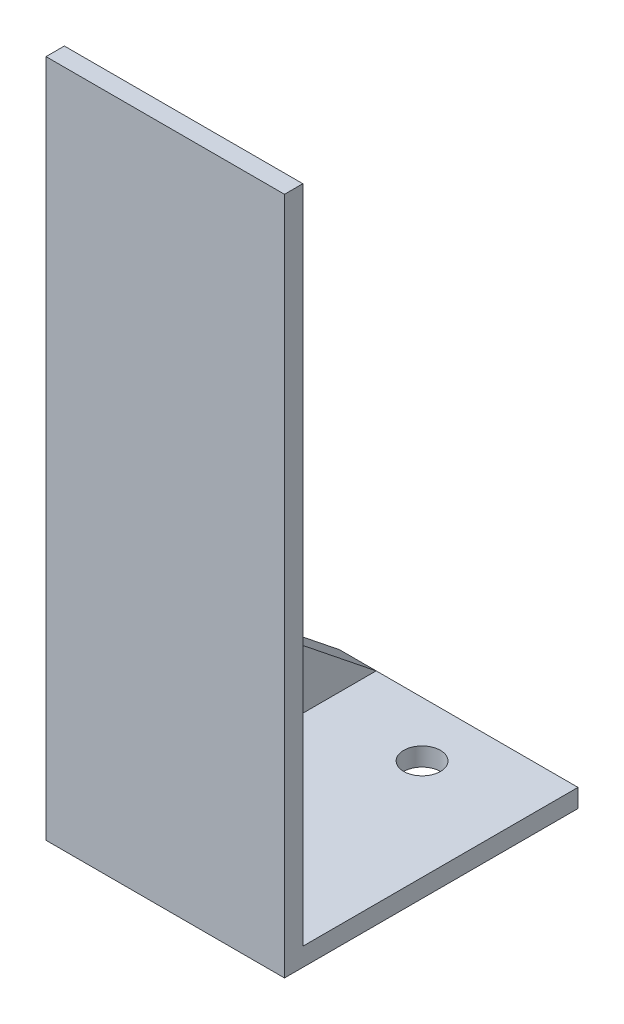
ISO-10303-21;
HEADER;
FILE_DESCRIPTION(('STEP AP214'),'2;1');
FILE_NAME('part.step','',(''),(''),'','','');
FILE_SCHEMA(('AUTOMOTIVE_DESIGN { 1 0 10303 214 1 1 1 1 }'));
ENDSEC;
DATA;
#1=APPLICATION_CONTEXT('core data for automotive mechanical design processes');
#2=APPLICATION_PROTOCOL_DEFINITION('international standard','automotive_design',2000,#1);
#3=PRODUCT_CONTEXT('',#1,'mechanical');
#4=PRODUCT('Part','Part','',(#3));
#5=PRODUCT_RELATED_PRODUCT_CATEGORY('part','',(#4));
#6=PRODUCT_DEFINITION_FORMATION('','',#4);
#7=PRODUCT_DEFINITION_CONTEXT('part definition',#1,'design');
#8=PRODUCT_DEFINITION('design','',#6,#7);
#9=PRODUCT_DEFINITION_SHAPE('','',#8);
#10=(LENGTH_UNIT() NAMED_UNIT(*) SI_UNIT(.MILLI.,.METRE.));
#11=(NAMED_UNIT(*) PLANE_ANGLE_UNIT() SI_UNIT($,.RADIAN.));
#12=(NAMED_UNIT(*) SI_UNIT($,.STERADIAN.) SOLID_ANGLE_UNIT());
#13=UNCERTAINTY_MEASURE_WITH_UNIT(LENGTH_MEASURE(1.E-05),#10,'distance_accuracy_value','');
#14=(GEOMETRIC_REPRESENTATION_CONTEXT(3) GLOBAL_UNCERTAINTY_ASSIGNED_CONTEXT((#13)) GLOBAL_UNIT_ASSIGNED_CONTEXT((#10,
#11,#12)) REPRESENTATION_CONTEXT('',''));
#15=CARTESIAN_POINT('',(0.,0.,0.));
#16=DIRECTION('',(0.,0.,1.));
#17=DIRECTION('',(1.,0.,0.));
#18=AXIS2_PLACEMENT_3D('',#15,#16,#17);
#19=CARTESIAN_POINT('',(146.05,6.35,0.));
#20=DIRECTION('',(0.,-1.,0.));
#21=DIRECTION('',(0.,0.,-1.));
#22=AXIS2_PLACEMENT_3D('',#19,#20,#21);
#23=PLANE('',#22);
#24=CARTESIAN_POINT('',(111.125,6.35,19.05));
#25=DIRECTION('',(0.,1.,0.));
#26=DIRECTION('',(0.,0.,1.));
#27=AXIS2_PLACEMENT_3D('',#24,#25,#26);
#28=CIRCLE('',#27,6.35);
#29=CARTESIAN_POINT('',(111.125,6.35,25.4));
#30=VERTEX_POINT('',#29);
#31=EDGE_CURVE('E158',#30,#30,#28,.T.);
#32=ORIENTED_EDGE('',*,*,#31,.F.);
#33=EDGE_LOOP('',(#32));
#34=FACE_BOUND('',#33,.T.);
#35=CARTESIAN_POINT('',(111.125,6.34999999999999,82.55));
#36=DIRECTION('',(0.,1.,0.));
#37=DIRECTION('',(0.,0.,1.));
#38=AXIS2_PLACEMENT_3D('',#35,#36,#37);
#39=CIRCLE('',#38,6.34999999999999);
#40=CARTESIAN_POINT('',(111.125,6.34999999999999,88.9));
#41=VERTEX_POINT('',#40);
#42=EDGE_CURVE('E162',#41,#41,#39,.T.);
#43=ORIENTED_EDGE('',*,*,#42,.F.);
#44=EDGE_LOOP('',(#43));
#45=FACE_BOUND('',#44,.T.);
#46=DIRECTION('',(0.,0.,1.));
#47=VECTOR('',#46,1.);
#48=CARTESIAN_POINT('',(76.2,6.34999999999999,95.25));
#49=LINE('',#48,#47);
#50=CARTESIAN_POINT('',(76.2,6.35,0.));
#51=VERTEX_POINT('',#50);
#52=CARTESIAN_POINT('',(76.2,6.34999999999999,95.25));
#53=VERTEX_POINT('',#52);
#54=EDGE_CURVE('E118',#51,#53,#49,.T.);
#55=ORIENTED_EDGE('',*,*,#54,.T.);
#56=DIRECTION('',(-1.,0.,0.));
#57=VECTOR('',#56,1.);
#58=CARTESIAN_POINT('',(146.05,6.34999999999999,95.25));
#59=LINE('',#58,#57);
#60=CARTESIAN_POINT('',(146.05,6.34999999999999,95.25));
#61=VERTEX_POINT('',#60);
#62=EDGE_CURVE('E43',#61,#53,#59,.T.);
#63=ORIENTED_EDGE('',*,*,#62,.F.);
#64=DIRECTION('',(0.,0.,1.));
#65=VECTOR('',#64,1.);
#66=CARTESIAN_POINT('',(146.05,6.35,0.));
#67=LINE('',#66,#65);
#68=CARTESIAN_POINT('',(146.05,6.35,0.));
#69=VERTEX_POINT('',#68);
#70=EDGE_CURVE('E136',#69,#61,#67,.T.);
#71=ORIENTED_EDGE('',*,*,#70,.F.);
#72=DIRECTION('',(-1.,0.,0.));
#73=VECTOR('',#72,1.);
#74=CARTESIAN_POINT('',(146.05,6.35,0.));
#75=LINE('',#74,#73);
#76=EDGE_CURVE('E11',#69,#51,#75,.T.);
#77=ORIENTED_EDGE('',*,*,#76,.T.);
#78=EDGE_LOOP('',(#55,#63,#71,#77));
#79=FACE_BOUND('',#78,.T.);
#80=ADVANCED_FACE('F34',(#34,#45,#79),#23,.F.);
#81=CARTESIAN_POINT('',(146.05,0.,0.));
#82=DIRECTION('',(0.,0.,1.));
#83=DIRECTION('',(1.,0.,0.));
#84=AXIS2_PLACEMENT_3D('',#81,#82,#83);
#85=PLANE('',#84);
#86=DIRECTION('',(-1.,0.,0.));
#87=VECTOR('',#86,1.);
#88=CARTESIAN_POINT('',(146.05,0.,0.));
#89=LINE('',#88,#87);
#90=CARTESIAN_POINT('',(146.05,0.,0.));
#91=VERTEX_POINT('',#90);
#92=CARTESIAN_POINT('',(63.5,0.,0.));
#93=VERTEX_POINT('',#92);
#94=EDGE_CURVE('E146',#91,#93,#89,.T.);
#95=ORIENTED_EDGE('',*,*,#94,.T.);
#96=DIRECTION('',(0.,1.,0.));
#97=VECTOR('',#96,1.);
#98=CARTESIAN_POINT('',(63.5,0.,0.));
#99=LINE('',#98,#97);
#100=CARTESIAN_POINT('',(63.5,6.35,0.));
#101=VERTEX_POINT('',#100);
#102=EDGE_CURVE('E108',#93,#101,#99,.T.);
#103=ORIENTED_EDGE('',*,*,#102,.T.);
#104=DIRECTION('',(-1.,0.,0.));
#105=VECTOR('',#104,1.);
#106=CARTESIAN_POINT('',(76.2,6.35,0.));
#107=LINE('',#106,#105);
#108=EDGE_CURVE('E51',#51,#101,#107,.T.);
#109=ORIENTED_EDGE('',*,*,#108,.F.);
#110=ORIENTED_EDGE('',*,*,#76,.F.);
#111=DIRECTION('',(0.,1.,0.));
#112=VECTOR('',#111,1.);
#113=CARTESIAN_POINT('',(146.05,0.,0.));
#114=LINE('',#113,#112);
#115=EDGE_CURVE('E133',#91,#69,#114,.T.);
#116=ORIENTED_EDGE('',*,*,#115,.F.);
#117=EDGE_LOOP('',(#95,#103,#109,#110,#116));
#118=FACE_BOUND('',#117,.T.);
#119=ADVANCED_FACE('F36',(#118),#85,.F.);
#120=CARTESIAN_POINT('',(146.05,6.34999999999999,95.25));
#121=DIRECTION('',(0.,0.,1.));
#122=DIRECTION('',(1.,0.,0.));
#123=AXIS2_PLACEMENT_3D('',#120,#121,#122);
#124=PLANE('',#123);
#125=DIRECTION('',(0.,1.,0.));
#126=VECTOR('',#125,1.);
#127=CARTESIAN_POINT('',(76.2,82.55,95.25));
#128=LINE('',#127,#126);
#129=CARTESIAN_POINT('',(76.2,82.55,95.25));
#130=VERTEX_POINT('',#129);
#131=EDGE_CURVE('E58',#53,#130,#128,.T.);
#132=ORIENTED_EDGE('',*,*,#131,.T.);
#133=DIRECTION('',(-1.,0.,0.));
#134=VECTOR('',#133,1.);
#135=CARTESIAN_POINT('',(76.2,82.55,95.25));
#136=LINE('',#135,#134);
#137=CARTESIAN_POINT('',(63.5,82.55,95.25));
#138=VERTEX_POINT('',#137);
#139=EDGE_CURVE('E110',#130,#138,#136,.T.);
#140=ORIENTED_EDGE('',*,*,#139,.T.);
#141=DIRECTION('',(0.,1.,0.));
#142=VECTOR('',#141,1.);
#143=CARTESIAN_POINT('',(63.5,6.34999999999999,95.25));
#144=LINE('',#143,#142);
#145=CARTESIAN_POINT('',(63.5,234.95,95.25));
#146=VERTEX_POINT('',#145);
#147=EDGE_CURVE('E100',#138,#146,#144,.T.);
#148=ORIENTED_EDGE('',*,*,#147,.T.);
#149=DIRECTION('',(-1.,0.,0.));
#150=VECTOR('',#149,1.);
#151=CARTESIAN_POINT('',(146.05,234.95,95.25));
#152=LINE('',#151,#150);
#153=CARTESIAN_POINT('',(146.05,234.95,95.25));
#154=VERTEX_POINT('',#153);
#155=EDGE_CURVE('E155',#154,#146,#152,.T.);
#156=ORIENTED_EDGE('',*,*,#155,.F.);
#157=DIRECTION('',(0.,1.,0.));
#158=VECTOR('',#157,1.);
#159=CARTESIAN_POINT('',(146.05,6.34999999999999,95.25));
#160=LINE('',#159,#158);
#161=EDGE_CURVE('E138',#61,#154,#160,.T.);
#162=ORIENTED_EDGE('',*,*,#161,.F.);
#163=ORIENTED_EDGE('',*,*,#62,.T.);
#164=EDGE_LOOP('',(#132,#140,#148,#156,#162,#163));
#165=FACE_BOUND('',#164,.T.);
#166=ADVANCED_FACE('F111',(#165),#124,.F.);
#167=CARTESIAN_POINT('',(146.05,234.95,101.6));
#168=DIRECTION('',(0.,-1.,0.));
#169=DIRECTION('',(0.,0.,-1.));
#170=AXIS2_PLACEMENT_3D('',#167,#168,#169);
#171=PLANE('',#170);
#172=ORIENTED_EDGE('',*,*,#155,.T.);
#173=DIRECTION('',(0.,0.,1.));
#174=VECTOR('',#173,1.);
#175=CARTESIAN_POINT('',(63.5,234.95,-44.45));
#176=LINE('',#175,#174);
#177=CARTESIAN_POINT('',(63.5,234.95,101.6));
#178=VERTEX_POINT('',#177);
#179=EDGE_CURVE('E105',#146,#178,#176,.T.);
#180=ORIENTED_EDGE('',*,*,#179,.T.);
#181=DIRECTION('',(-1.,0.,0.));
#182=VECTOR('',#181,1.);
#183=CARTESIAN_POINT('',(146.05,234.95,101.6));
#184=LINE('',#183,#182);
#185=CARTESIAN_POINT('',(146.05,234.95,101.6));
#186=VERTEX_POINT('',#185);
#187=EDGE_CURVE('E152',#186,#178,#184,.T.);
#188=ORIENTED_EDGE('',*,*,#187,.F.);
#189=DIRECTION('',(0.,0.,1.));
#190=VECTOR('',#189,1.);
#191=CARTESIAN_POINT('',(146.05,234.95,101.6));
#192=LINE('',#191,#190);
#193=EDGE_CURVE('E140',#154,#186,#192,.T.);
#194=ORIENTED_EDGE('',*,*,#193,.F.);
#195=EDGE_LOOP('',(#172,#180,#188,#194));
#196=FACE_BOUND('',#195,.T.);
#197=ADVANCED_FACE('F186',(#196),#171,.F.);
#198=CARTESIAN_POINT('',(146.05,0.,101.6));
#199=DIRECTION('',(0.,0.,-1.));
#200=DIRECTION('',(-1.,0.,0.));
#201=AXIS2_PLACEMENT_3D('',#198,#199,#200);
#202=PLANE('',#201);
#203=ORIENTED_EDGE('',*,*,#187,.T.);
#204=DIRECTION('',(0.,1.,0.));
#205=VECTOR('',#204,1.);
#206=CARTESIAN_POINT('',(63.5,0.,101.6));
#207=LINE('',#206,#205);
#208=CARTESIAN_POINT('',(63.5,0.,101.6));
#209=VERTEX_POINT('',#208);
#210=EDGE_CURVE('E126',#209,#178,#207,.T.);
#211=ORIENTED_EDGE('',*,*,#210,.F.);
#212=DIRECTION('',(-1.,0.,0.));
#213=VECTOR('',#212,1.);
#214=CARTESIAN_POINT('',(146.05,0.,101.6));
#215=LINE('',#214,#213);
#216=CARTESIAN_POINT('',(146.05,0.,101.6));
#217=VERTEX_POINT('',#216);
#218=EDGE_CURVE('E149',#217,#209,#215,.T.);
#219=ORIENTED_EDGE('',*,*,#218,.F.);
#220=DIRECTION('',(0.,-1.,0.));
#221=VECTOR('',#220,1.);
#222=CARTESIAN_POINT('',(146.05,6.34999999999999,101.6));
#223=LINE('',#222,#221);
#224=EDGE_CURVE('E142',#186,#217,#223,.T.);
#225=ORIENTED_EDGE('',*,*,#224,.F.);
#226=EDGE_LOOP('',(#203,#211,#219,#225));
#227=FACE_BOUND('',#226,.T.);
#228=ADVANCED_FACE('F195',(#227),#202,.F.);
#229=CARTESIAN_POINT('',(146.05,0.,0.));
#230=DIRECTION('',(0.,1.,0.));
#231=DIRECTION('',(0.,0.,1.));
#232=AXIS2_PLACEMENT_3D('',#229,#230,#231);
#233=PLANE('',#232);
#234=CARTESIAN_POINT('',(111.125,0.,19.05));
#235=DIRECTION('',(0.,1.,0.));
#236=DIRECTION('',(0.,0.,1.));
#237=AXIS2_PLACEMENT_3D('',#234,#235,#236);
#238=CIRCLE('',#237,6.35);
#239=CARTESIAN_POINT('',(111.125,0.,25.4));
#240=VERTEX_POINT('',#239);
#241=EDGE_CURVE('E38',#240,#240,#238,.T.);
#242=ORIENTED_EDGE('',*,*,#241,.T.);
#243=EDGE_LOOP('',(#242));
#244=FACE_BOUND('',#243,.T.);
#245=CARTESIAN_POINT('',(111.125,0.,82.55));
#246=DIRECTION('',(0.,1.,0.));
#247=DIRECTION('',(0.,0.,1.));
#248=AXIS2_PLACEMENT_3D('',#245,#246,#247);
#249=CIRCLE('',#248,6.34999999999999);
#250=CARTESIAN_POINT('',(111.125,0.,88.9));
#251=VERTEX_POINT('',#250);
#252=EDGE_CURVE('E122',#251,#251,#249,.T.);
#253=ORIENTED_EDGE('',*,*,#252,.T.);
#254=EDGE_LOOP('',(#253));
#255=FACE_BOUND('',#254,.T.);
#256=ORIENTED_EDGE('',*,*,#218,.T.);
#257=DIRECTION('',(0.,0.,1.));
#258=VECTOR('',#257,1.);
#259=CARTESIAN_POINT('',(63.5,0.,-44.45));
#260=LINE('',#259,#258);
#261=EDGE_CURVE('E129',#93,#209,#260,.T.);
#262=ORIENTED_EDGE('',*,*,#261,.F.);
#263=ORIENTED_EDGE('',*,*,#94,.F.);
#264=DIRECTION('',(0.,0.,-1.));
#265=VECTOR('',#264,1.);
#266=CARTESIAN_POINT('',(146.05,0.,0.));
#267=LINE('',#266,#265);
#268=EDGE_CURVE('E144',#217,#91,#267,.T.);
#269=ORIENTED_EDGE('',*,*,#268,.F.);
#270=EDGE_LOOP('',(#256,#262,#263,#269));
#271=FACE_BOUND('',#270,.T.);
#272=ADVANCED_FACE('F199',(#244,#255,#271),#233,.F.);
#273=CARTESIAN_POINT('',(146.05,0.,0.));
#274=DIRECTION('',(1.,0.,0.));
#275=DIRECTION('',(0.,0.,-1.));
#276=AXIS2_PLACEMENT_3D('',#273,#274,#275);
#277=PLANE('',#276);
#278=ORIENTED_EDGE('',*,*,#115,.T.);
#279=ORIENTED_EDGE('',*,*,#70,.T.);
#280=ORIENTED_EDGE('',*,*,#161,.T.);
#281=ORIENTED_EDGE('',*,*,#193,.T.);
#282=ORIENTED_EDGE('',*,*,#224,.T.);
#283=ORIENTED_EDGE('',*,*,#268,.T.);
#284=EDGE_LOOP('',(#278,#279,#280,#281,#282,#283));
#285=FACE_BOUND('',#284,.T.);
#286=ADVANCED_FACE('F176',(#285),#277,.T.);
#287=CARTESIAN_POINT('',(63.5,0.,-44.45));
#288=DIRECTION('',(1.,0.,0.));
#289=DIRECTION('',(0.,0.,-1.));
#290=AXIS2_PLACEMENT_3D('',#287,#288,#289);
#291=PLANE('',#290);
#292=ORIENTED_EDGE('',*,*,#261,.T.);
#293=ORIENTED_EDGE('',*,*,#210,.T.);
#294=ORIENTED_EDGE('',*,*,#179,.F.);
#295=ORIENTED_EDGE('',*,*,#147,.F.);
#296=DIRECTION('',(0.,-0.624695047554424,-0.78086880944303));
#297=VECTOR('',#296,1.);
#298=CARTESIAN_POINT('',(63.5,6.35,0.));
#299=LINE('',#298,#297);
#300=EDGE_CURVE('E103',#138,#101,#299,.T.);
#301=ORIENTED_EDGE('',*,*,#300,.T.);
#302=ORIENTED_EDGE('',*,*,#102,.F.);
#303=EDGE_LOOP('',(#292,#293,#294,#295,#301,#302));
#304=FACE_BOUND('',#303,.T.);
#305=ADVANCED_FACE('F101',(#304),#291,.F.);
#306=CARTESIAN_POINT('',(76.2,6.35,0.));
#307=DIRECTION('',(0.,0.78086880944303,-0.624695047554424));
#308=DIRECTION('',(0.,0.624695047554424,0.78086880944303));
#309=AXIS2_PLACEMENT_3D('',#306,#307,#308);
#310=PLANE('',#309);
#311=ORIENTED_EDGE('',*,*,#300,.F.);
#312=ORIENTED_EDGE('',*,*,#139,.F.);
#313=DIRECTION('',(0.,-0.624695047554424,-0.78086880944303));
#314=VECTOR('',#313,1.);
#315=CARTESIAN_POINT('',(76.2,6.35,0.));
#316=LINE('',#315,#314);
#317=EDGE_CURVE('E115',#130,#51,#316,.T.);
#318=ORIENTED_EDGE('',*,*,#317,.T.);
#319=ORIENTED_EDGE('',*,*,#108,.T.);
#320=EDGE_LOOP('',(#311,#312,#318,#319));
#321=FACE_BOUND('',#320,.T.);
#322=ADVANCED_FACE('F117',(#321),#310,.T.);
#323=CARTESIAN_POINT('',(76.2,0.,0.));
#324=DIRECTION('',(-1.,0.,0.));
#325=DIRECTION('',(0.,0.,1.));
#326=AXIS2_PLACEMENT_3D('',#323,#324,#325);
#327=PLANE('',#326);
#328=ORIENTED_EDGE('',*,*,#54,.F.);
#329=ORIENTED_EDGE('',*,*,#317,.F.);
#330=ORIENTED_EDGE('',*,*,#131,.F.);
#331=EDGE_LOOP('',(#328,#329,#330));
#332=FACE_BOUND('',#331,.T.);
#333=ADVANCED_FACE('F170',(#332),#327,.F.);
#334=CARTESIAN_POINT('',(111.125,-6.35000000000001,82.55));
#335=DIRECTION('',(0.,1.,0.));
#336=DIRECTION('',(0.,0.,1.));
#337=AXIS2_PLACEMENT_3D('',#334,#335,#336);
#338=CYLINDRICAL_SURFACE('',#337,6.34999999999999);
#339=ORIENTED_EDGE('',*,*,#42,.T.);
#340=EDGE_LOOP('',(#339));
#341=FACE_BOUND('',#340,.T.);
#342=ORIENTED_EDGE('',*,*,#252,.F.);
#343=EDGE_LOOP('',(#342));
#344=FACE_BOUND('',#343,.T.);
#345=ADVANCED_FACE('F212',(#341,#344),#338,.F.);
#346=CARTESIAN_POINT('',(111.125,-6.35,19.05));
#347=DIRECTION('',(0.,1.,0.));
#348=DIRECTION('',(0.,0.,1.));
#349=AXIS2_PLACEMENT_3D('',#346,#347,#348);
#350=CYLINDRICAL_SURFACE('',#349,6.35);
#351=ORIENTED_EDGE('',*,*,#31,.T.);
#352=EDGE_LOOP('',(#351));
#353=FACE_BOUND('',#352,.T.);
#354=ORIENTED_EDGE('',*,*,#241,.F.);
#355=EDGE_LOOP('',(#354));
#356=FACE_BOUND('',#355,.T.);
#357=ADVANCED_FACE('F215',(#353,#356),#350,.F.);
#358=CLOSED_SHELL('',(#80,#119,#166,#197,#228,#272,#286,#305,#322,#333,#345,#357));
#359=MANIFOLD_SOLID_BREP('B2',#358);
#360=ADVANCED_BREP_SHAPE_REPRESENTATION('',(#18,#359),#14);
#361=SHAPE_DEFINITION_REPRESENTATION(#9,#360);
ENDSEC;
END-ISO-10303-21;
